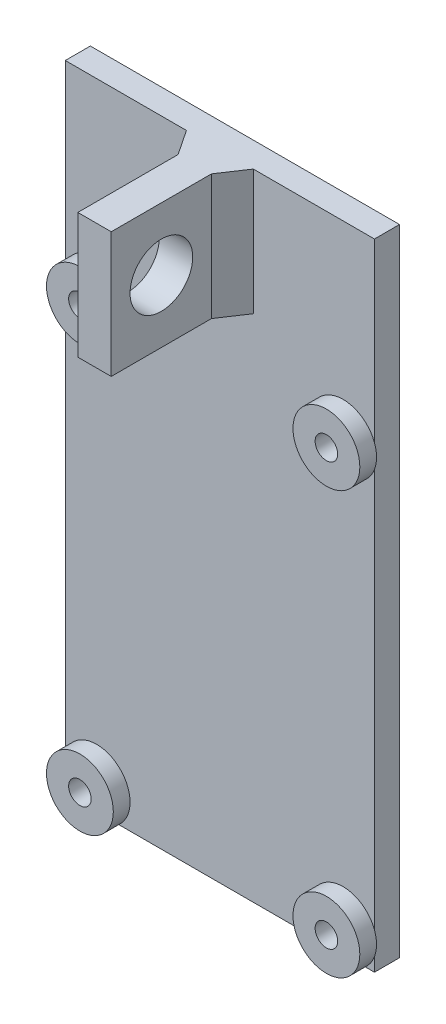
ISO-10303-21;
HEADER;
FILE_DESCRIPTION(('STEP AP214'),'2;1');
FILE_NAME('part.step','',(''),(''),'','','');
FILE_SCHEMA(('AUTOMOTIVE_DESIGN { 1 0 10303 214 1 1 1 1 }'));
ENDSEC;
DATA;
#1=APPLICATION_CONTEXT('core data for automotive mechanical design processes');
#2=APPLICATION_PROTOCOL_DEFINITION('international standard','automotive_design',2000,#1);
#3=PRODUCT_CONTEXT('',#1,'mechanical');
#4=PRODUCT('Part','Part','',(#3));
#5=PRODUCT_RELATED_PRODUCT_CATEGORY('part','',(#4));
#6=PRODUCT_DEFINITION_FORMATION('','',#4);
#7=PRODUCT_DEFINITION_CONTEXT('part definition',#1,'design');
#8=PRODUCT_DEFINITION('design','',#6,#7);
#9=PRODUCT_DEFINITION_SHAPE('','',#8);
#10=(LENGTH_UNIT() NAMED_UNIT(*) SI_UNIT(.MILLI.,.METRE.));
#11=(NAMED_UNIT(*) PLANE_ANGLE_UNIT() SI_UNIT($,.RADIAN.));
#12=(NAMED_UNIT(*) SI_UNIT($,.STERADIAN.) SOLID_ANGLE_UNIT());
#13=UNCERTAINTY_MEASURE_WITH_UNIT(LENGTH_MEASURE(1.E-05),#10,'distance_accuracy_value','');
#14=(GEOMETRIC_REPRESENTATION_CONTEXT(3) GLOBAL_UNCERTAINTY_ASSIGNED_CONTEXT((#13)) GLOBAL_UNIT_ASSIGNED_CONTEXT((#10,
#11,#12)) REPRESENTATION_CONTEXT('',''));
#15=CARTESIAN_POINT('',(0.,0.,0.));
#16=DIRECTION('',(0.,0.,1.));
#17=DIRECTION('',(1.,0.,0.));
#18=AXIS2_PLACEMENT_3D('',#15,#16,#17);
#19=CARTESIAN_POINT('',(0.,0.,3.));
#20=DIRECTION('',(0.,0.,-1.));
#21=DIRECTION('',(-1.,0.,0.));
#22=AXIS2_PLACEMENT_3D('',#19,#20,#21);
#23=PLANE('',#22);
#24=DIRECTION('',(-1.,0.,0.));
#25=VECTOR('',#24,1.);
#26=CARTESIAN_POINT('',(0.,76.,3.));
#27=LINE('',#26,#25);
#28=CARTESIAN_POINT('',(37.,76.,3.));
#29=VERTEX_POINT('',#28);
#30=CARTESIAN_POINT('',(22.5,76.,3.));
#31=VERTEX_POINT('',#30);
#32=EDGE_CURVE('E245',#29,#31,#27,.T.);
#33=ORIENTED_EDGE('',*,*,#32,.T.);
#34=DIRECTION('',(0.,-1.,0.));
#35=VECTOR('',#34,1.);
#36=CARTESIAN_POINT('',(22.5,84.5440037453175,3.));
#37=LINE('',#36,#35);
#38=CARTESIAN_POINT('',(22.5,61.,3.));
#39=VERTEX_POINT('',#38);
#40=EDGE_CURVE('E322',#31,#39,#37,.T.);
#41=ORIENTED_EDGE('',*,*,#40,.T.);
#42=DIRECTION('',(1.,0.,0.));
#43=VECTOR('',#42,1.);
#44=CARTESIAN_POINT('',(16.5,61.,3.));
#45=LINE('',#44,#43);
#46=CARTESIAN_POINT('',(14.5,61.,3.));
#47=VERTEX_POINT('',#46);
#48=EDGE_CURVE('E48',#47,#39,#45,.T.);
#49=ORIENTED_EDGE('',*,*,#48,.F.);
#50=DIRECTION('',(0.,-1.,0.));
#51=VECTOR('',#50,1.);
#52=CARTESIAN_POINT('',(14.5,84.5440037453175,3.));
#53=LINE('',#52,#51);
#54=CARTESIAN_POINT('',(14.5,76.,3.));
#55=VERTEX_POINT('',#54);
#56=EDGE_CURVE('E52',#55,#47,#53,.T.);
#57=ORIENTED_EDGE('',*,*,#56,.F.);
#58=CARTESIAN_POINT('',(0.,76.,3.));
#59=VERTEX_POINT('',#58);
#60=EDGE_CURVE('E243',#55,#59,#27,.T.);
#61=ORIENTED_EDGE('',*,*,#60,.T.);
#62=DIRECTION('',(0.,-1.,0.));
#63=VECTOR('',#62,1.);
#64=CARTESIAN_POINT('',(0.,0.,3.));
#65=LINE('',#64,#63);
#66=CARTESIAN_POINT('',(0.,54.8919410907075,3.));
#67=VERTEX_POINT('',#66);
#68=EDGE_CURVE('E229',#59,#67,#65,.T.);
#69=ORIENTED_EDGE('',*,*,#68,.T.);
#70=CARTESIAN_POINT('',(3.75,53.5,3.));
#71=DIRECTION('',(0.,0.,-1.));
#72=DIRECTION('',(-1.,0.,0.));
#73=AXIS2_PLACEMENT_3D('',#70,#71,#72);
#74=CIRCLE('',#73,4.);
#75=CARTESIAN_POINT('',(0.,52.1080589092925,3.));
#76=VERTEX_POINT('',#75);
#77=EDGE_CURVE('E11',#76,#67,#74,.F.);
#78=ORIENTED_EDGE('',*,*,#77,.F.);
#79=CARTESIAN_POINT('',(0.,4.39194109070751,3.));
#80=VERTEX_POINT('',#79);
#81=EDGE_CURVE('E233',#76,#80,#65,.T.);
#82=ORIENTED_EDGE('',*,*,#81,.T.);
#83=CARTESIAN_POINT('',(3.75,3.,3.));
#84=DIRECTION('',(0.,0.,1.));
#85=DIRECTION('',(1.,0.,0.));
#86=AXIS2_PLACEMENT_3D('',#83,#84,#85);
#87=CIRCLE('',#86,4.);
#88=CARTESIAN_POINT('',(6.39575131106459,0.,3.));
#89=VERTEX_POINT('',#88);
#90=EDGE_CURVE('E228',#89,#80,#87,.T.);
#91=ORIENTED_EDGE('',*,*,#90,.F.);
#92=DIRECTION('',(1.,0.,0.));
#93=VECTOR('',#92,1.);
#94=CARTESIAN_POINT('',(0.,0.,3.));
#95=LINE('',#94,#93);
#96=CARTESIAN_POINT('',(30.6042486889354,0.,3.));
#97=VERTEX_POINT('',#96);
#98=EDGE_CURVE('E286',#89,#97,#95,.T.);
#99=ORIENTED_EDGE('',*,*,#98,.T.);
#100=CARTESIAN_POINT('',(33.25,3.,3.));
#101=DIRECTION('',(0.,0.,1.));
#102=DIRECTION('',(1.,0.,0.));
#103=AXIS2_PLACEMENT_3D('',#100,#101,#102);
#104=CIRCLE('',#103,4.00000000000001);
#105=CARTESIAN_POINT('',(37.,4.39194109070753,3.));
#106=VERTEX_POINT('',#105);
#107=EDGE_CURVE('E211',#106,#97,#104,.T.);
#108=ORIENTED_EDGE('',*,*,#107,.F.);
#109=DIRECTION('',(0.,1.,0.));
#110=VECTOR('',#109,1.);
#111=CARTESIAN_POINT('',(37.,0.,3.));
#112=LINE('',#111,#110);
#113=CARTESIAN_POINT('',(37.,52.1080589092925,3.));
#114=VERTEX_POINT('',#113);
#115=EDGE_CURVE('E305',#106,#114,#112,.T.);
#116=ORIENTED_EDGE('',*,*,#115,.T.);
#117=CARTESIAN_POINT('',(33.25,53.5,3.));
#118=DIRECTION('',(0.,0.,1.));
#119=DIRECTION('',(1.,0.,0.));
#120=AXIS2_PLACEMENT_3D('',#117,#118,#119);
#121=CIRCLE('',#120,4.00000000000001);
#122=CARTESIAN_POINT('',(37.,54.8919410907075,3.));
#123=VERTEX_POINT('',#122);
#124=EDGE_CURVE('E198',#123,#114,#121,.T.);
#125=ORIENTED_EDGE('',*,*,#124,.F.);
#126=EDGE_CURVE('E238',#123,#29,#112,.T.);
#127=ORIENTED_EDGE('',*,*,#126,.T.);
#128=EDGE_LOOP('',(#33,#41,#49,#57,#61,#69,#78,#82,#91,#99,#108,#116,#125,#127));
#129=FACE_BOUND('',#128,.T.);
#130=ADVANCED_FACE('F33',(#129),#23,.F.);
#131=CARTESIAN_POINT('',(33.25,3.,3.));
#132=DIRECTION('',(0.,0.,-1.));
#133=DIRECTION('',(-1.,0.,0.));
#134=AXIS2_PLACEMENT_3D('',#131,#132,#133);
#135=CIRCLE('',#134,4.00000000000001);
#136=CARTESIAN_POINT('',(35.8957513110646,0.,3.));
#137=VERTEX_POINT('',#136);
#138=CARTESIAN_POINT('',(37.,1.60805890929247,3.));
#139=VERTEX_POINT('',#138);
#140=EDGE_CURVE('E41',#137,#139,#135,.F.);
#141=ORIENTED_EDGE('',*,*,#140,.F.);
#142=CARTESIAN_POINT('',(37.,0.,3.));
#143=VERTEX_POINT('',#142);
#144=EDGE_CURVE('E231',#137,#143,#95,.T.);
#145=ORIENTED_EDGE('',*,*,#144,.T.);
#146=EDGE_CURVE('E240',#143,#139,#112,.T.);
#147=ORIENTED_EDGE('',*,*,#146,.T.);
#148=EDGE_LOOP('',(#141,#145,#147));
#149=FACE_BOUND('',#148,.T.);
#150=ADVANCED_FACE('F295',(#149),#23,.F.);
#151=CARTESIAN_POINT('',(0.,1.60805890929249,3.));
#152=VERTEX_POINT('',#151);
#153=CARTESIAN_POINT('',(1.10424868893541,0.,3.));
#154=VERTEX_POINT('',#153);
#155=EDGE_CURVE('E269',#152,#154,#87,.T.);
#156=ORIENTED_EDGE('',*,*,#155,.F.);
#157=CARTESIAN_POINT('',(0.,0.,3.));
#158=VERTEX_POINT('',#157);
#159=EDGE_CURVE('E257',#152,#158,#65,.T.);
#160=ORIENTED_EDGE('',*,*,#159,.T.);
#161=EDGE_CURVE('E235',#158,#154,#95,.T.);
#162=ORIENTED_EDGE('',*,*,#161,.T.);
#163=EDGE_LOOP('',(#156,#160,#162));
#164=FACE_BOUND('',#163,.T.);
#165=ADVANCED_FACE('F374',(#164),#23,.F.);
#166=CARTESIAN_POINT('',(0.,0.,3.));
#167=DIRECTION('',(1.,0.,0.));
#168=DIRECTION('',(0.,0.,-1.));
#169=AXIS2_PLACEMENT_3D('',#166,#167,#168);
#170=PLANE('',#169);
#171=DIRECTION('',(0.,-1.,0.));
#172=VECTOR('',#171,1.);
#173=CARTESIAN_POINT('',(0.,0.,0.));
#174=LINE('',#173,#172);
#175=CARTESIAN_POINT('',(0.,76.,0.));
#176=VERTEX_POINT('',#175);
#177=CARTESIAN_POINT('',(0.,0.,0.));
#178=VERTEX_POINT('',#177);
#179=EDGE_CURVE('E224',#176,#178,#174,.T.);
#180=ORIENTED_EDGE('',*,*,#179,.T.);
#181=DIRECTION('',(0.,0.,-1.));
#182=VECTOR('',#181,1.);
#183=CARTESIAN_POINT('',(0.,0.,3.));
#184=LINE('',#183,#182);
#185=EDGE_CURVE('E266',#158,#178,#184,.T.);
#186=ORIENTED_EDGE('',*,*,#185,.F.);
#187=ORIENTED_EDGE('',*,*,#159,.F.);
#188=EDGE_CURVE('E234',#80,#152,#65,.T.);
#189=ORIENTED_EDGE('',*,*,#188,.F.);
#190=ORIENTED_EDGE('',*,*,#81,.F.);
#191=EDGE_CURVE('E232',#67,#76,#65,.T.);
#192=ORIENTED_EDGE('',*,*,#191,.F.);
#193=ORIENTED_EDGE('',*,*,#68,.F.);
#194=DIRECTION('',(0.,0.,-1.));
#195=VECTOR('',#194,1.);
#196=CARTESIAN_POINT('',(0.,76.,3.));
#197=LINE('',#196,#195);
#198=EDGE_CURVE('E248',#59,#176,#197,.T.);
#199=ORIENTED_EDGE('',*,*,#198,.T.);
#200=EDGE_LOOP('',(#180,#186,#187,#189,#190,#192,#193,#199));
#201=FACE_BOUND('',#200,.T.);
#202=ADVANCED_FACE('F35',(#201),#170,.F.);
#203=CARTESIAN_POINT('',(0.,0.,3.));
#204=DIRECTION('',(0.,1.,0.));
#205=DIRECTION('',(0.,0.,1.));
#206=AXIS2_PLACEMENT_3D('',#203,#204,#205);
#207=PLANE('',#206);
#208=DIRECTION('',(1.,0.,0.));
#209=VECTOR('',#208,1.);
#210=CARTESIAN_POINT('',(0.,0.,0.));
#211=LINE('',#210,#209);
#212=CARTESIAN_POINT('',(37.,0.,0.));
#213=VERTEX_POINT('',#212);
#214=EDGE_CURVE('E251',#178,#213,#211,.T.);
#215=ORIENTED_EDGE('',*,*,#214,.T.);
#216=DIRECTION('',(0.,0.,-1.));
#217=VECTOR('',#216,1.);
#218=CARTESIAN_POINT('',(37.,0.,3.));
#219=LINE('',#218,#217);
#220=EDGE_CURVE('E263',#143,#213,#219,.T.);
#221=ORIENTED_EDGE('',*,*,#220,.F.);
#222=ORIENTED_EDGE('',*,*,#144,.F.);
#223=EDGE_CURVE('E287',#97,#137,#95,.T.);
#224=ORIENTED_EDGE('',*,*,#223,.F.);
#225=ORIENTED_EDGE('',*,*,#98,.F.);
#226=EDGE_CURVE('E239',#154,#89,#95,.T.);
#227=ORIENTED_EDGE('',*,*,#226,.F.);
#228=ORIENTED_EDGE('',*,*,#161,.F.);
#229=ORIENTED_EDGE('',*,*,#185,.T.);
#230=EDGE_LOOP('',(#215,#221,#222,#224,#225,#227,#228,#229));
#231=FACE_BOUND('',#230,.T.);
#232=ADVANCED_FACE('F298',(#231),#207,.F.);
#233=CARTESIAN_POINT('',(37.,0.,3.));
#234=DIRECTION('',(-1.,0.,0.));
#235=DIRECTION('',(0.,0.,1.));
#236=AXIS2_PLACEMENT_3D('',#233,#234,#235);
#237=PLANE('',#236);
#238=DIRECTION('',(0.,1.,0.));
#239=VECTOR('',#238,1.);
#240=CARTESIAN_POINT('',(37.,0.,0.));
#241=LINE('',#240,#239);
#242=CARTESIAN_POINT('',(37.,76.,0.));
#243=VERTEX_POINT('',#242);
#244=EDGE_CURVE('E253',#213,#243,#241,.T.);
#245=ORIENTED_EDGE('',*,*,#244,.T.);
#246=DIRECTION('',(0.,0.,-1.));
#247=VECTOR('',#246,1.);
#248=CARTESIAN_POINT('',(37.,76.,3.));
#249=LINE('',#248,#247);
#250=EDGE_CURVE('E260',#29,#243,#249,.T.);
#251=ORIENTED_EDGE('',*,*,#250,.F.);
#252=ORIENTED_EDGE('',*,*,#126,.F.);
#253=EDGE_CURVE('E307',#114,#123,#112,.T.);
#254=ORIENTED_EDGE('',*,*,#253,.F.);
#255=ORIENTED_EDGE('',*,*,#115,.F.);
#256=EDGE_CURVE('E244',#139,#106,#112,.T.);
#257=ORIENTED_EDGE('',*,*,#256,.F.);
#258=ORIENTED_EDGE('',*,*,#146,.F.);
#259=ORIENTED_EDGE('',*,*,#220,.T.);
#260=EDGE_LOOP('',(#245,#251,#252,#254,#255,#257,#258,#259));
#261=FACE_BOUND('',#260,.T.);
#262=ADVANCED_FACE('F301',(#261),#237,.F.);
#263=CARTESIAN_POINT('',(0.,76.,3.));
#264=DIRECTION('',(0.,-1.,0.));
#265=DIRECTION('',(0.,0.,-1.));
#266=AXIS2_PLACEMENT_3D('',#263,#264,#265);
#267=PLANE('',#266);
#268=ORIENTED_EDGE('',*,*,#60,.F.);
#269=DIRECTION('',(0.55470019622523,0.,0.832050294337843));
#270=VECTOR('',#269,1.);
#271=CARTESIAN_POINT('',(14.5,76.,3.));
#272=LINE('',#271,#270);
#273=CARTESIAN_POINT('',(16.5,76.,6.));
#274=VERTEX_POINT('',#273);
#275=EDGE_CURVE('E320',#55,#274,#272,.T.);
#276=ORIENTED_EDGE('',*,*,#275,.T.);
#277=DIRECTION('',(0.,0.,-1.));
#278=VECTOR('',#277,1.);
#279=CARTESIAN_POINT('',(16.5,76.,18.));
#280=LINE('',#279,#278);
#281=CARTESIAN_POINT('',(16.5,76.,18.));
#282=VERTEX_POINT('',#281);
#283=EDGE_CURVE('E172',#282,#274,#280,.T.);
#284=ORIENTED_EDGE('',*,*,#283,.F.);
#285=DIRECTION('',(-1.,0.,0.));
#286=VECTOR('',#285,1.);
#287=CARTESIAN_POINT('',(16.5,76.,18.));
#288=LINE('',#287,#286);
#289=CARTESIAN_POINT('',(20.5,76.,18.));
#290=VERTEX_POINT('',#289);
#291=EDGE_CURVE('E341',#290,#282,#288,.T.);
#292=ORIENTED_EDGE('',*,*,#291,.F.);
#293=DIRECTION('',(0.,0.,-1.));
#294=VECTOR('',#293,1.);
#295=CARTESIAN_POINT('',(20.5,76.,18.));
#296=LINE('',#295,#294);
#297=CARTESIAN_POINT('',(20.5,76.,6.));
#298=VERTEX_POINT('',#297);
#299=EDGE_CURVE('E168',#290,#298,#296,.T.);
#300=ORIENTED_EDGE('',*,*,#299,.T.);
#301=DIRECTION('',(0.554700196225231,0.,-0.832050294337843));
#302=VECTOR('',#301,1.);
#303=CARTESIAN_POINT('',(20.5,76.,6.));
#304=LINE('',#303,#302);
#305=EDGE_CURVE('E149',#298,#31,#304,.T.);
#306=ORIENTED_EDGE('',*,*,#305,.T.);
#307=ORIENTED_EDGE('',*,*,#32,.F.);
#308=ORIENTED_EDGE('',*,*,#250,.T.);
#309=DIRECTION('',(-1.,0.,0.));
#310=VECTOR('',#309,1.);
#311=CARTESIAN_POINT('',(0.,76.,0.));
#312=LINE('',#311,#310);
#313=EDGE_CURVE('E255',#243,#176,#312,.T.);
#314=ORIENTED_EDGE('',*,*,#313,.T.);
#315=ORIENTED_EDGE('',*,*,#198,.F.);
#316=EDGE_LOOP('',(#268,#276,#284,#292,#300,#306,#307,#308,#314,#315));
#317=FACE_BOUND('',#316,.T.);
#318=ADVANCED_FACE('F317',(#317),#267,.F.);
#319=CARTESIAN_POINT('',(0.,0.,0.));
#320=DIRECTION('',(0.,0.,-1.));
#321=DIRECTION('',(-1.,0.,0.));
#322=AXIS2_PLACEMENT_3D('',#319,#320,#321);
#323=PLANE('',#322);
#324=ORIENTED_EDGE('',*,*,#179,.F.);
#325=ORIENTED_EDGE('',*,*,#313,.F.);
#326=ORIENTED_EDGE('',*,*,#244,.F.);
#327=ORIENTED_EDGE('',*,*,#214,.F.);
#328=EDGE_LOOP('',(#324,#325,#326,#327));
#329=FACE_BOUND('',#328,.T.);
#330=ADVANCED_FACE('F433',(#329),#323,.T.);
#331=CARTESIAN_POINT('',(3.75,3.,3.));
#332=DIRECTION('',(0.,0.,1.));
#333=DIRECTION('',(1.,0.,0.));
#334=AXIS2_PLACEMENT_3D('',#331,#332,#333);
#335=PLANE('',#334);
#336=EDGE_CURVE('E225',#80,#152,#87,.T.);
#337=ORIENTED_EDGE('',*,*,#336,.F.);
#338=ORIENTED_EDGE('',*,*,#188,.T.);
#339=EDGE_LOOP('',(#337,#338));
#340=FACE_BOUND('',#339,.T.);
#341=ADVANCED_FACE('F431',(#340),#335,.F.);
#342=EDGE_CURVE('E218',#154,#89,#87,.T.);
#343=ORIENTED_EDGE('',*,*,#342,.F.);
#344=ORIENTED_EDGE('',*,*,#226,.T.);
#345=EDGE_LOOP('',(#343,#344));
#346=FACE_BOUND('',#345,.T.);
#347=ADVANCED_FACE('F282',(#346),#335,.F.);
#348=CARTESIAN_POINT('',(3.75,3.,5.));
#349=DIRECTION('',(0.,0.,1.));
#350=DIRECTION('',(1.,0.,0.));
#351=AXIS2_PLACEMENT_3D('',#348,#349,#350);
#352=PLANE('',#351);
#353=CARTESIAN_POINT('',(3.75,3.,5.));
#354=DIRECTION('',(0.,0.,1.));
#355=DIRECTION('',(1.,0.,0.));
#356=AXIS2_PLACEMENT_3D('',#353,#354,#355);
#357=CIRCLE('',#356,4.);
#358=CARTESIAN_POINT('',(7.75,3.,5.));
#359=VERTEX_POINT('',#358);
#360=EDGE_CURVE('E221',#359,#359,#357,.T.);
#361=ORIENTED_EDGE('',*,*,#360,.T.);
#362=EDGE_LOOP('',(#361));
#363=FACE_BOUND('',#362,.T.);
#364=CARTESIAN_POINT('',(3.75,3.,5.));
#365=DIRECTION('',(0.,0.,1.));
#366=DIRECTION('',(1.,0.,0.));
#367=AXIS2_PLACEMENT_3D('',#364,#365,#366);
#368=CIRCLE('',#367,1.35);
#369=CARTESIAN_POINT('',(5.1,3.,5.));
#370=VERTEX_POINT('',#369);
#371=EDGE_CURVE('E215',#370,#370,#368,.T.);
#372=ORIENTED_EDGE('',*,*,#371,.F.);
#373=EDGE_LOOP('',(#372));
#374=FACE_BOUND('',#373,.T.);
#375=ADVANCED_FACE('F427',(#363,#374),#352,.T.);
#376=CARTESIAN_POINT('',(3.75,3.,5.));
#377=DIRECTION('',(0.,0.,-1.));
#378=DIRECTION('',(-1.,0.,0.));
#379=AXIS2_PLACEMENT_3D('',#376,#377,#378);
#380=CYLINDRICAL_SURFACE('',#379,4.);
#381=ORIENTED_EDGE('',*,*,#360,.F.);
#382=EDGE_LOOP('',(#381));
#383=FACE_BOUND('',#382,.T.);
#384=ORIENTED_EDGE('',*,*,#336,.T.);
#385=ORIENTED_EDGE('',*,*,#155,.T.);
#386=ORIENTED_EDGE('',*,*,#342,.T.);
#387=ORIENTED_EDGE('',*,*,#90,.T.);
#388=EDGE_LOOP('',(#384,#385,#386,#387));
#389=FACE_BOUND('',#388,.T.);
#390=ADVANCED_FACE('F278',(#383,#389),#380,.T.);
#391=CARTESIAN_POINT('',(3.75,3.,5.));
#392=DIRECTION('',(0.,0.,-1.));
#393=DIRECTION('',(-1.,0.,0.));
#394=AXIS2_PLACEMENT_3D('',#391,#392,#393);
#395=CYLINDRICAL_SURFACE('',#394,1.35);
#396=ORIENTED_EDGE('',*,*,#371,.T.);
#397=EDGE_LOOP('',(#396));
#398=FACE_BOUND('',#397,.T.);
#399=CARTESIAN_POINT('',(3.75,3.,3.));
#400=DIRECTION('',(0.,0.,1.));
#401=DIRECTION('',(1.,0.,0.));
#402=AXIS2_PLACEMENT_3D('',#399,#400,#401);
#403=CIRCLE('',#402,1.35);
#404=CARTESIAN_POINT('',(5.1,3.,3.));
#405=VERTEX_POINT('',#404);
#406=EDGE_CURVE('E210',#405,#405,#403,.T.);
#407=ORIENTED_EDGE('',*,*,#406,.F.);
#408=EDGE_LOOP('',(#407));
#409=FACE_BOUND('',#408,.T.);
#410=ADVANCED_FACE('F384',(#398,#409),#395,.F.);
#411=ORIENTED_EDGE('',*,*,#406,.T.);
#412=EDGE_LOOP('',(#411));
#413=FACE_BOUND('',#412,.T.);
#414=ADVANCED_FACE('F370',(#413),#23,.F.);
#415=CARTESIAN_POINT('',(33.25,3.,3.));
#416=DIRECTION('',(0.,0.,1.));
#417=DIRECTION('',(1.,0.,0.));
#418=AXIS2_PLACEMENT_3D('',#415,#416,#417);
#419=PLANE('',#418);
#420=EDGE_CURVE('E214',#97,#137,#104,.T.);
#421=ORIENTED_EDGE('',*,*,#420,.F.);
#422=ORIENTED_EDGE('',*,*,#223,.T.);
#423=EDGE_LOOP('',(#421,#422));
#424=FACE_BOUND('',#423,.T.);
#425=ADVANCED_FACE('F383',(#424),#419,.F.);
#426=EDGE_CURVE('E204',#139,#106,#104,.T.);
#427=ORIENTED_EDGE('',*,*,#426,.F.);
#428=ORIENTED_EDGE('',*,*,#256,.T.);
#429=EDGE_LOOP('',(#427,#428));
#430=FACE_BOUND('',#429,.T.);
#431=ADVANCED_FACE('F390',(#430),#419,.F.);
#432=CARTESIAN_POINT('',(33.25,3.,5.));
#433=DIRECTION('',(0.,0.,1.));
#434=DIRECTION('',(1.,0.,0.));
#435=AXIS2_PLACEMENT_3D('',#432,#433,#434);
#436=PLANE('',#435);
#437=CARTESIAN_POINT('',(33.25,3.,5.));
#438=DIRECTION('',(0.,0.,1.));
#439=DIRECTION('',(1.,0.,0.));
#440=AXIS2_PLACEMENT_3D('',#437,#438,#439);
#441=CIRCLE('',#440,4.00000000000001);
#442=CARTESIAN_POINT('',(37.25,3.,5.));
#443=VERTEX_POINT('',#442);
#444=EDGE_CURVE('E207',#443,#443,#441,.T.);
#445=ORIENTED_EDGE('',*,*,#444,.T.);
#446=EDGE_LOOP('',(#445));
#447=FACE_BOUND('',#446,.T.);
#448=CARTESIAN_POINT('',(33.25,3.,5.));
#449=DIRECTION('',(0.,0.,1.));
#450=DIRECTION('',(1.,0.,0.));
#451=AXIS2_PLACEMENT_3D('',#448,#449,#450);
#452=CIRCLE('',#451,1.35);
#453=CARTESIAN_POINT('',(34.6,3.,5.));
#454=VERTEX_POINT('',#453);
#455=EDGE_CURVE('E201',#454,#454,#452,.T.);
#456=ORIENTED_EDGE('',*,*,#455,.F.);
#457=EDGE_LOOP('',(#456));
#458=FACE_BOUND('',#457,.T.);
#459=ADVANCED_FACE('F418',(#447,#458),#436,.T.);
#460=CARTESIAN_POINT('',(33.25,3.,5.));
#461=DIRECTION('',(0.,0.,-1.));
#462=DIRECTION('',(-1.,0.,0.));
#463=AXIS2_PLACEMENT_3D('',#460,#461,#462);
#464=CYLINDRICAL_SURFACE('',#463,4.00000000000001);
#465=ORIENTED_EDGE('',*,*,#444,.F.);
#466=EDGE_LOOP('',(#465));
#467=FACE_BOUND('',#466,.T.);
#468=ORIENTED_EDGE('',*,*,#107,.T.);
#469=ORIENTED_EDGE('',*,*,#420,.T.);
#470=ORIENTED_EDGE('',*,*,#140,.T.);
#471=ORIENTED_EDGE('',*,*,#426,.T.);
#472=EDGE_LOOP('',(#468,#469,#470,#471));
#473=FACE_BOUND('',#472,.T.);
#474=ADVANCED_FACE('F410',(#467,#473),#464,.T.);
#475=CARTESIAN_POINT('',(33.25,3.,5.));
#476=DIRECTION('',(0.,0.,-1.));
#477=DIRECTION('',(-1.,0.,0.));
#478=AXIS2_PLACEMENT_3D('',#475,#476,#477);
#479=CYLINDRICAL_SURFACE('',#478,1.35);
#480=ORIENTED_EDGE('',*,*,#455,.T.);
#481=EDGE_LOOP('',(#480));
#482=FACE_BOUND('',#481,.T.);
#483=CARTESIAN_POINT('',(33.25,3.,3.));
#484=DIRECTION('',(0.,0.,1.));
#485=DIRECTION('',(1.,0.,0.));
#486=AXIS2_PLACEMENT_3D('',#483,#484,#485);
#487=CIRCLE('',#486,1.35);
#488=CARTESIAN_POINT('',(34.6,3.,3.));
#489=VERTEX_POINT('',#488);
#490=EDGE_CURVE('E197',#489,#489,#487,.T.);
#491=ORIENTED_EDGE('',*,*,#490,.F.);
#492=EDGE_LOOP('',(#491));
#493=FACE_BOUND('',#492,.T.);
#494=ADVANCED_FACE('F402',(#482,#493),#479,.F.);
#495=ORIENTED_EDGE('',*,*,#490,.T.);
#496=EDGE_LOOP('',(#495));
#497=FACE_BOUND('',#496,.T.);
#498=ADVANCED_FACE('F375',(#497),#23,.F.);
#499=CARTESIAN_POINT('',(33.25,53.5,3.));
#500=DIRECTION('',(0.,0.,1.));
#501=DIRECTION('',(1.,0.,0.));
#502=AXIS2_PLACEMENT_3D('',#499,#500,#501);
#503=PLANE('',#502);
#504=EDGE_CURVE('E191',#114,#123,#121,.T.);
#505=ORIENTED_EDGE('',*,*,#504,.F.);
#506=ORIENTED_EDGE('',*,*,#253,.T.);
#507=EDGE_LOOP('',(#505,#506));
#508=FACE_BOUND('',#507,.T.);
#509=ADVANCED_FACE('F401',(#508),#503,.F.);
#510=CARTESIAN_POINT('',(33.25,53.5,5.));
#511=DIRECTION('',(0.,0.,1.));
#512=DIRECTION('',(1.,0.,0.));
#513=AXIS2_PLACEMENT_3D('',#510,#511,#512);
#514=PLANE('',#513);
#515=CARTESIAN_POINT('',(33.25,53.5,5.));
#516=DIRECTION('',(0.,0.,1.));
#517=DIRECTION('',(1.,0.,0.));
#518=AXIS2_PLACEMENT_3D('',#515,#516,#517);
#519=CIRCLE('',#518,4.00000000000001);
#520=CARTESIAN_POINT('',(37.25,53.5,5.));
#521=VERTEX_POINT('',#520);
#522=EDGE_CURVE('E194',#521,#521,#519,.T.);
#523=ORIENTED_EDGE('',*,*,#522,.T.);
#524=EDGE_LOOP('',(#523));
#525=FACE_BOUND('',#524,.T.);
#526=CARTESIAN_POINT('',(33.25,53.5,5.));
#527=DIRECTION('',(0.,0.,1.));
#528=DIRECTION('',(1.,0.,0.));
#529=AXIS2_PLACEMENT_3D('',#526,#527,#528);
#530=CIRCLE('',#529,1.35);
#531=CARTESIAN_POINT('',(34.6,53.5,5.));
#532=VERTEX_POINT('',#531);
#533=EDGE_CURVE('E188',#532,#532,#530,.T.);
#534=ORIENTED_EDGE('',*,*,#533,.F.);
#535=EDGE_LOOP('',(#534));
#536=FACE_BOUND('',#535,.T.);
#537=ADVANCED_FACE('F408',(#525,#536),#514,.T.);
#538=CARTESIAN_POINT('',(33.25,53.5,5.));
#539=DIRECTION('',(0.,0.,-1.));
#540=DIRECTION('',(-1.,0.,0.));
#541=AXIS2_PLACEMENT_3D('',#538,#539,#540);
#542=CYLINDRICAL_SURFACE('',#541,4.00000000000001);
#543=ORIENTED_EDGE('',*,*,#522,.F.);
#544=EDGE_LOOP('',(#543));
#545=FACE_BOUND('',#544,.T.);
#546=ORIENTED_EDGE('',*,*,#124,.T.);
#547=ORIENTED_EDGE('',*,*,#504,.T.);
#548=EDGE_LOOP('',(#546,#547));
#549=FACE_BOUND('',#548,.T.);
#550=ADVANCED_FACE('F423',(#545,#549),#542,.T.);
#551=CARTESIAN_POINT('',(33.25,53.5,5.));
#552=DIRECTION('',(0.,0.,-1.));
#553=DIRECTION('',(-1.,0.,0.));
#554=AXIS2_PLACEMENT_3D('',#551,#552,#553);
#555=CYLINDRICAL_SURFACE('',#554,1.35);
#556=ORIENTED_EDGE('',*,*,#533,.T.);
#557=EDGE_LOOP('',(#556));
#558=FACE_BOUND('',#557,.T.);
#559=CARTESIAN_POINT('',(33.25,53.5,3.));
#560=DIRECTION('',(0.,0.,1.));
#561=DIRECTION('',(1.,0.,0.));
#562=AXIS2_PLACEMENT_3D('',#559,#560,#561);
#563=CIRCLE('',#562,1.35);
#564=CARTESIAN_POINT('',(34.6,53.5,3.));
#565=VERTEX_POINT('',#564);
#566=EDGE_CURVE('E185',#565,#565,#563,.T.);
#567=ORIENTED_EDGE('',*,*,#566,.F.);
#568=EDGE_LOOP('',(#567));
#569=FACE_BOUND('',#568,.T.);
#570=ADVANCED_FACE('F515',(#558,#569),#555,.F.);
#571=ORIENTED_EDGE('',*,*,#566,.T.);
#572=EDGE_LOOP('',(#571));
#573=FACE_BOUND('',#572,.T.);
#574=ADVANCED_FACE('F376',(#573),#23,.F.);
#575=CARTESIAN_POINT('',(3.75,53.5,3.));
#576=DIRECTION('',(0.,0.,1.));
#577=DIRECTION('',(1.,0.,0.));
#578=AXIS2_PLACEMENT_3D('',#575,#576,#577);
#579=PLANE('',#578);
#580=CARTESIAN_POINT('',(3.75,53.5,3.));
#581=DIRECTION('',(0.,0.,1.));
#582=DIRECTION('',(1.,0.,0.));
#583=AXIS2_PLACEMENT_3D('',#580,#581,#582);
#584=CIRCLE('',#583,4.);
#585=EDGE_CURVE('E179',#67,#76,#584,.T.);
#586=ORIENTED_EDGE('',*,*,#585,.F.);
#587=ORIENTED_EDGE('',*,*,#191,.T.);
#588=EDGE_LOOP('',(#586,#587));
#589=FACE_BOUND('',#588,.T.);
#590=ADVANCED_FACE('F534',(#589),#579,.F.);
#591=CARTESIAN_POINT('',(3.75,53.5,5.));
#592=DIRECTION('',(0.,0.,1.));
#593=DIRECTION('',(1.,0.,0.));
#594=AXIS2_PLACEMENT_3D('',#591,#592,#593);
#595=PLANE('',#594);
#596=CARTESIAN_POINT('',(3.75,53.5,5.));
#597=DIRECTION('',(0.,0.,1.));
#598=DIRECTION('',(1.,0.,0.));
#599=AXIS2_PLACEMENT_3D('',#596,#597,#598);
#600=CIRCLE('',#599,4.);
#601=CARTESIAN_POINT('',(7.75,53.5,5.));
#602=VERTEX_POINT('',#601);
#603=EDGE_CURVE('E182',#602,#602,#600,.T.);
#604=ORIENTED_EDGE('',*,*,#603,.T.);
#605=EDGE_LOOP('',(#604));
#606=FACE_BOUND('',#605,.T.);
#607=CARTESIAN_POINT('',(3.75,53.5,5.));
#608=DIRECTION('',(0.,0.,1.));
#609=DIRECTION('',(1.,0.,0.));
#610=AXIS2_PLACEMENT_3D('',#607,#608,#609);
#611=CIRCLE('',#610,1.35);
#612=CARTESIAN_POINT('',(5.1,53.5,5.));
#613=VERTEX_POINT('',#612);
#614=EDGE_CURVE('E176',#613,#613,#611,.T.);
#615=ORIENTED_EDGE('',*,*,#614,.F.);
#616=EDGE_LOOP('',(#615));
#617=FACE_BOUND('',#616,.T.);
#618=ADVANCED_FACE('F543',(#606,#617),#595,.T.);
#619=CARTESIAN_POINT('',(3.75,53.5,5.));
#620=DIRECTION('',(0.,0.,-1.));
#621=DIRECTION('',(-1.,0.,0.));
#622=AXIS2_PLACEMENT_3D('',#619,#620,#621);
#623=CYLINDRICAL_SURFACE('',#622,4.);
#624=ORIENTED_EDGE('',*,*,#603,.F.);
#625=EDGE_LOOP('',(#624));
#626=FACE_BOUND('',#625,.T.);
#627=ORIENTED_EDGE('',*,*,#585,.T.);
#628=ORIENTED_EDGE('',*,*,#77,.T.);
#629=EDGE_LOOP('',(#627,#628));
#630=FACE_BOUND('',#629,.T.);
#631=ADVANCED_FACE('F553',(#626,#630),#623,.T.);
#632=CARTESIAN_POINT('',(3.75,53.5,5.));
#633=DIRECTION('',(0.,0.,-1.));
#634=DIRECTION('',(-1.,0.,0.));
#635=AXIS2_PLACEMENT_3D('',#632,#633,#634);
#636=CYLINDRICAL_SURFACE('',#635,1.35);
#637=ORIENTED_EDGE('',*,*,#614,.T.);
#638=EDGE_LOOP('',(#637));
#639=FACE_BOUND('',#638,.T.);
#640=CARTESIAN_POINT('',(3.75,53.5,3.));
#641=DIRECTION('',(0.,0.,1.));
#642=DIRECTION('',(1.,0.,0.));
#643=AXIS2_PLACEMENT_3D('',#640,#641,#642);
#644=CIRCLE('',#643,1.35);
#645=CARTESIAN_POINT('',(5.1,53.5,3.));
#646=VERTEX_POINT('',#645);
#647=EDGE_CURVE('E170',#646,#646,#644,.T.);
#648=ORIENTED_EDGE('',*,*,#647,.F.);
#649=EDGE_LOOP('',(#648));
#650=FACE_BOUND('',#649,.T.);
#651=ADVANCED_FACE('F380',(#639,#650),#636,.F.);
#652=ORIENTED_EDGE('',*,*,#647,.T.);
#653=EDGE_LOOP('',(#652));
#654=FACE_BOUND('',#653,.T.);
#655=ADVANCED_FACE('F369',(#654),#23,.F.);
#656=CARTESIAN_POINT('',(16.5,76.,18.));
#657=DIRECTION('',(1.,0.,0.));
#658=DIRECTION('',(0.,0.,-1.));
#659=AXIS2_PLACEMENT_3D('',#656,#657,#658);
#660=PLANE('',#659);
#661=CARTESIAN_POINT('',(16.5,68.5,12.));
#662=DIRECTION('',(1.,0.,0.));
#663=DIRECTION('',(0.,0.,-1.));
#664=AXIS2_PLACEMENT_3D('',#661,#662,#663);
#665=CIRCLE('',#664,3.75);
#666=CARTESIAN_POINT('',(16.5,68.5,8.25));
#667=VERTEX_POINT('',#666);
#668=EDGE_CURVE('E332',#667,#667,#665,.T.);
#669=ORIENTED_EDGE('',*,*,#668,.T.);
#670=EDGE_LOOP('',(#669));
#671=FACE_BOUND('',#670,.T.);
#672=ORIENTED_EDGE('',*,*,#283,.T.);
#673=DIRECTION('',(0.,-1.,0.));
#674=VECTOR('',#673,1.);
#675=CARTESIAN_POINT('',(16.5,84.5440037453175,6.));
#676=LINE('',#675,#674);
#677=CARTESIAN_POINT('',(16.5,61.,6.));
#678=VERTEX_POINT('',#677);
#679=EDGE_CURVE('E154',#274,#678,#676,.T.);
#680=ORIENTED_EDGE('',*,*,#679,.T.);
#681=DIRECTION('',(0.,0.,-1.));
#682=VECTOR('',#681,1.);
#683=CARTESIAN_POINT('',(16.5,61.,18.));
#684=LINE('',#683,#682);
#685=CARTESIAN_POINT('',(16.5,61.,18.));
#686=VERTEX_POINT('',#685);
#687=EDGE_CURVE('E167',#686,#678,#684,.T.);
#688=ORIENTED_EDGE('',*,*,#687,.F.);
#689=DIRECTION('',(0.,-1.,0.));
#690=VECTOR('',#689,1.);
#691=CARTESIAN_POINT('',(16.5,76.,18.));
#692=LINE('',#691,#690);
#693=EDGE_CURVE('E335',#282,#686,#692,.T.);
#694=ORIENTED_EDGE('',*,*,#693,.F.);
#695=EDGE_LOOP('',(#672,#680,#688,#694));
#696=FACE_BOUND('',#695,.T.);
#697=ADVANCED_FACE('F346',(#671,#696),#660,.F.);
#698=CARTESIAN_POINT('',(16.5,61.,18.));
#699=DIRECTION('',(0.,1.,0.));
#700=DIRECTION('',(0.,0.,1.));
#701=AXIS2_PLACEMENT_3D('',#698,#699,#700);
#702=PLANE('',#701);
#703=ORIENTED_EDGE('',*,*,#687,.T.);
#704=DIRECTION('',(-0.55470019622523,0.,-0.832050294337843));
#705=VECTOR('',#704,1.);
#706=CARTESIAN_POINT('',(14.5,61.,3.));
#707=LINE('',#706,#705);
#708=EDGE_CURVE('E155',#678,#47,#707,.T.);
#709=ORIENTED_EDGE('',*,*,#708,.T.);
#710=ORIENTED_EDGE('',*,*,#48,.T.);
#711=DIRECTION('',(-0.554700196225231,0.,0.832050294337842));
#712=VECTOR('',#711,1.);
#713=CARTESIAN_POINT('',(20.5,61.,6.));
#714=LINE('',#713,#712);
#715=CARTESIAN_POINT('',(20.5,61.,6.));
#716=VERTEX_POINT('',#715);
#717=EDGE_CURVE('E148',#39,#716,#714,.T.);
#718=ORIENTED_EDGE('',*,*,#717,.T.);
#719=DIRECTION('',(0.,0.,-1.));
#720=VECTOR('',#719,1.);
#721=CARTESIAN_POINT('',(20.5,61.,18.));
#722=LINE('',#721,#720);
#723=CARTESIAN_POINT('',(20.5,61.,18.));
#724=VERTEX_POINT('',#723);
#725=EDGE_CURVE('E161',#724,#716,#722,.T.);
#726=ORIENTED_EDGE('',*,*,#725,.F.);
#727=DIRECTION('',(1.,0.,0.));
#728=VECTOR('',#727,1.);
#729=CARTESIAN_POINT('',(16.5,61.,18.));
#730=LINE('',#729,#728);
#731=EDGE_CURVE('E338',#686,#724,#730,.T.);
#732=ORIENTED_EDGE('',*,*,#731,.F.);
#733=EDGE_LOOP('',(#703,#709,#710,#718,#726,#732));
#734=FACE_BOUND('',#733,.T.);
#735=ADVANCED_FACE('F160',(#734),#702,.F.);
#736=CARTESIAN_POINT('',(20.5,76.,18.));
#737=DIRECTION('',(-1.,0.,0.));
#738=DIRECTION('',(0.,0.,1.));
#739=AXIS2_PLACEMENT_3D('',#736,#737,#738);
#740=PLANE('',#739);
#741=CARTESIAN_POINT('',(20.5,68.5,12.));
#742=DIRECTION('',(1.,0.,0.));
#743=DIRECTION('',(0.,0.,-1.));
#744=AXIS2_PLACEMENT_3D('',#741,#742,#743);
#745=CIRCLE('',#744,3.75);
#746=CARTESIAN_POINT('',(20.5,68.5,8.25));
#747=VERTEX_POINT('',#746);
#748=EDGE_CURVE('E319',#747,#747,#745,.T.);
#749=ORIENTED_EDGE('',*,*,#748,.F.);
#750=EDGE_LOOP('',(#749));
#751=FACE_BOUND('',#750,.T.);
#752=ORIENTED_EDGE('',*,*,#725,.T.);
#753=DIRECTION('',(0.,-1.,0.));
#754=VECTOR('',#753,1.);
#755=CARTESIAN_POINT('',(20.5,84.5440037453175,6.));
#756=LINE('',#755,#754);
#757=EDGE_CURVE('E144',#298,#716,#756,.T.);
#758=ORIENTED_EDGE('',*,*,#757,.F.);
#759=ORIENTED_EDGE('',*,*,#299,.F.);
#760=DIRECTION('',(0.,1.,0.));
#761=VECTOR('',#760,1.);
#762=CARTESIAN_POINT('',(20.5,76.,18.));
#763=LINE('',#762,#761);
#764=EDGE_CURVE('E166',#724,#290,#763,.T.);
#765=ORIENTED_EDGE('',*,*,#764,.F.);
#766=EDGE_LOOP('',(#752,#758,#759,#765));
#767=FACE_BOUND('',#766,.T.);
#768=ADVANCED_FACE('F165',(#751,#767),#740,.F.);
#769=CARTESIAN_POINT('',(0.,0.,18.));
#770=DIRECTION('',(0.,0.,1.));
#771=DIRECTION('',(1.,0.,0.));
#772=AXIS2_PLACEMENT_3D('',#769,#770,#771);
#773=PLANE('',#772);
#774=ORIENTED_EDGE('',*,*,#693,.T.);
#775=ORIENTED_EDGE('',*,*,#731,.T.);
#776=ORIENTED_EDGE('',*,*,#764,.T.);
#777=ORIENTED_EDGE('',*,*,#291,.T.);
#778=EDGE_LOOP('',(#774,#775,#776,#777));
#779=FACE_BOUND('',#778,.T.);
#780=ADVANCED_FACE('F355',(#779),#773,.T.);
#781=CARTESIAN_POINT('',(-0.250000000000004,68.5,12.));
#782=DIRECTION('',(1.,0.,0.));
#783=DIRECTION('',(0.,0.,-1.));
#784=AXIS2_PLACEMENT_3D('',#781,#782,#783);
#785=CYLINDRICAL_SURFACE('',#784,3.75);
#786=ORIENTED_EDGE('',*,*,#748,.T.);
#787=EDGE_LOOP('',(#786));
#788=FACE_BOUND('',#787,.T.);
#789=ORIENTED_EDGE('',*,*,#668,.F.);
#790=EDGE_LOOP('',(#789));
#791=FACE_BOUND('',#790,.T.);
#792=ADVANCED_FACE('F357',(#788,#791),#785,.F.);
#793=CARTESIAN_POINT('',(20.5,84.5440037453175,6.));
#794=DIRECTION('',(0.832050294337843,0.,0.554700196225231));
#795=DIRECTION('',(0.554700196225231,0.,-0.832050294337843));
#796=AXIS2_PLACEMENT_3D('',#793,#794,#795);
#797=PLANE('',#796);
#798=ORIENTED_EDGE('',*,*,#305,.F.);
#799=ORIENTED_EDGE('',*,*,#757,.T.);
#800=ORIENTED_EDGE('',*,*,#717,.F.);
#801=ORIENTED_EDGE('',*,*,#40,.F.);
#802=EDGE_LOOP('',(#798,#799,#800,#801));
#803=FACE_BOUND('',#802,.T.);
#804=ADVANCED_FACE('F146',(#803),#797,.T.);
#805=CARTESIAN_POINT('',(14.5,84.5440037453175,3.));
#806=DIRECTION('',(-0.832050294337843,0.,0.55470019622523));
#807=DIRECTION('',(0.55470019622523,0.,0.832050294337843));
#808=AXIS2_PLACEMENT_3D('',#805,#806,#807);
#809=PLANE('',#808);
#810=ORIENTED_EDGE('',*,*,#275,.F.);
#811=ORIENTED_EDGE('',*,*,#56,.T.);
#812=ORIENTED_EDGE('',*,*,#708,.F.);
#813=ORIENTED_EDGE('',*,*,#679,.F.);
#814=EDGE_LOOP('',(#810,#811,#812,#813));
#815=FACE_BOUND('',#814,.T.);
#816=ADVANCED_FACE('F353',(#815),#809,.T.);
#817=CLOSED_SHELL('',(#130,#150,#165,#202,#232,#262,#318,#330,#341,#347,#375,#390,#410,#414,
#425,#431,#459,#474,#494,#498,#509,#537,#550,#570,#574,#590,#618,#631,#651,#655,#697,#735,#768,
#780,#792,#804,#816));
#818=MANIFOLD_SOLID_BREP('B2',#817);
#819=ADVANCED_BREP_SHAPE_REPRESENTATION('',(#18,#818),#14);
#820=SHAPE_DEFINITION_REPRESENTATION(#9,#819);
ENDSEC;
END-ISO-10303-21;
